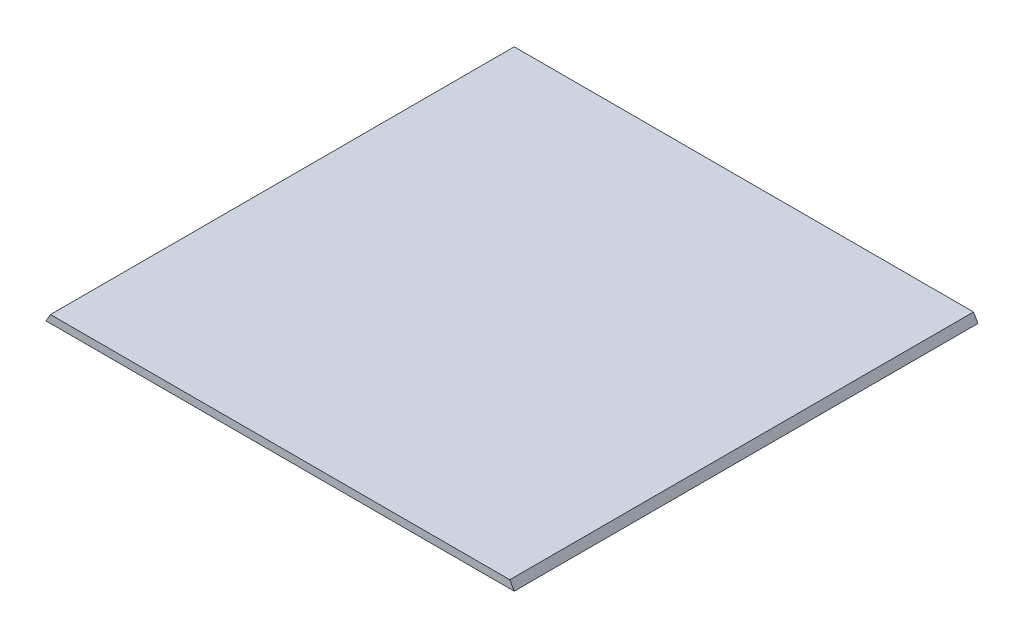
ISO-10303-21;
HEADER;
FILE_DESCRIPTION(('STEP AP214'),'2;1');
FILE_NAME('part.step','',(''),(''),'','','');
FILE_SCHEMA(('AUTOMOTIVE_DESIGN { 1 0 10303 214 1 1 1 1 }'));
ENDSEC;
DATA;
#1=APPLICATION_CONTEXT('core data for automotive mechanical design processes');
#2=APPLICATION_PROTOCOL_DEFINITION('international standard','automotive_design',2000,#1);
#3=PRODUCT_CONTEXT('',#1,'mechanical');
#4=PRODUCT('Part','Part','',(#3));
#5=PRODUCT_RELATED_PRODUCT_CATEGORY('part','',(#4));
#6=PRODUCT_DEFINITION_FORMATION('','',#4);
#7=PRODUCT_DEFINITION_CONTEXT('part definition',#1,'design');
#8=PRODUCT_DEFINITION('design','',#6,#7);
#9=PRODUCT_DEFINITION_SHAPE('','',#8);
#10=(LENGTH_UNIT() NAMED_UNIT(*) SI_UNIT(.MILLI.,.METRE.));
#11=(NAMED_UNIT(*) PLANE_ANGLE_UNIT() SI_UNIT($,.RADIAN.));
#12=(NAMED_UNIT(*) SI_UNIT($,.STERADIAN.) SOLID_ANGLE_UNIT());
#13=UNCERTAINTY_MEASURE_WITH_UNIT(LENGTH_MEASURE(1.E-05),#10,'distance_accuracy_value','');
#14=(GEOMETRIC_REPRESENTATION_CONTEXT(3) GLOBAL_UNCERTAINTY_ASSIGNED_CONTEXT((#13)) GLOBAL_UNIT_ASSIGNED_CONTEXT((#10,
#11,#12)) REPRESENTATION_CONTEXT('',''));
#15=CARTESIAN_POINT('',(0.,0.,0.));
#16=DIRECTION('',(0.,0.,1.));
#17=DIRECTION('',(1.,0.,0.));
#18=AXIS2_PLACEMENT_3D('',#15,#16,#17);
#19=CARTESIAN_POINT('',(0.,6.35,381.));
#20=DIRECTION('',(0.,0.,-1.));
#21=DIRECTION('',(-1.,0.,0.));
#22=AXIS2_PLACEMENT_3D('',#19,#20,#21);
#23=PLANE('',#22);
#24=DIRECTION('',(1.,0.,0.));
#25=VECTOR('',#24,1.);
#26=CARTESIAN_POINT('',(0.,6.35,381.));
#27=LINE('',#26,#25);
#28=CARTESIAN_POINT('',(3.66617420935418,6.35,381.));
#29=VERTEX_POINT('',#28);
#30=CARTESIAN_POINT('',(381.,6.35,381.));
#31=VERTEX_POINT('',#30);
#32=EDGE_CURVE('E99',#29,#31,#27,.T.);
#33=ORIENTED_EDGE('',*,*,#32,.F.);
#34=DIRECTION('',(0.500000000000001,0.866025403784438,0.));
#35=VECTOR('',#34,1.);
#36=CARTESIAN_POINT('',(0.,0.,381.));
#37=LINE('',#36,#35);
#38=CARTESIAN_POINT('',(0.,0.,381.));
#39=VERTEX_POINT('',#38);
#40=EDGE_CURVE('E75',#39,#29,#37,.T.);
#41=ORIENTED_EDGE('',*,*,#40,.F.);
#42=DIRECTION('',(1.,0.,0.));
#43=VECTOR('',#42,1.);
#44=CARTESIAN_POINT('',(0.,0.,381.));
#45=LINE('',#44,#43);
#46=CARTESIAN_POINT('',(384.666174209354,0.,381.));
#47=VERTEX_POINT('',#46);
#48=EDGE_CURVE('E70',#39,#47,#45,.T.);
#49=ORIENTED_EDGE('',*,*,#48,.T.);
#50=DIRECTION('',(-0.499999999999999,0.866025403784439,0.));
#51=VECTOR('',#50,1.);
#52=CARTESIAN_POINT('',(384.666174209354,0.,381.));
#53=LINE('',#52,#51);
#54=EDGE_CURVE('E74',#47,#31,#53,.T.);
#55=ORIENTED_EDGE('',*,*,#54,.T.);
#56=EDGE_LOOP('',(#33,#41,#49,#55));
#57=FACE_BOUND('',#56,.T.);
#58=ADVANCED_FACE('F33',(#57),#23,.F.);
#59=CARTESIAN_POINT('',(0.,6.35,0.));
#60=DIRECTION('',(0.,0.,1.));
#61=DIRECTION('',(1.,0.,0.));
#62=AXIS2_PLACEMENT_3D('',#59,#60,#61);
#63=PLANE('',#62);
#64=DIRECTION('',(-1.,0.,0.));
#65=VECTOR('',#64,1.);
#66=CARTESIAN_POINT('',(0.,0.,0.));
#67=LINE('',#66,#65);
#68=CARTESIAN_POINT('',(384.666174209354,0.,0.));
#69=VERTEX_POINT('',#68);
#70=CARTESIAN_POINT('',(0.,0.,0.));
#71=VERTEX_POINT('',#70);
#72=EDGE_CURVE('E36',#69,#71,#67,.T.);
#73=ORIENTED_EDGE('',*,*,#72,.T.);
#74=DIRECTION('',(0.500000000000001,0.866025403784438,0.));
#75=VECTOR('',#74,1.);
#76=CARTESIAN_POINT('',(0.,0.,0.));
#77=LINE('',#76,#75);
#78=CARTESIAN_POINT('',(3.66617420935418,6.35,0.));
#79=VERTEX_POINT('',#78);
#80=EDGE_CURVE('E92',#71,#79,#77,.T.);
#81=ORIENTED_EDGE('',*,*,#80,.T.);
#82=DIRECTION('',(-1.,0.,0.));
#83=VECTOR('',#82,1.);
#84=CARTESIAN_POINT('',(0.,6.35,0.));
#85=LINE('',#84,#83);
#86=CARTESIAN_POINT('',(381.,6.35,0.));
#87=VERTEX_POINT('',#86);
#88=EDGE_CURVE('E11',#87,#79,#85,.T.);
#89=ORIENTED_EDGE('',*,*,#88,.F.);
#90=DIRECTION('',(0.499999999999999,-0.866025403784439,0.));
#91=VECTOR('',#90,1.);
#92=CARTESIAN_POINT('',(384.666174209354,0.,0.));
#93=LINE('',#92,#91);
#94=EDGE_CURVE('E86',#87,#69,#93,.T.);
#95=ORIENTED_EDGE('',*,*,#94,.T.);
#96=EDGE_LOOP('',(#73,#81,#89,#95));
#97=FACE_BOUND('',#96,.T.);
#98=ADVANCED_FACE('F106',(#97),#63,.F.);
#99=CARTESIAN_POINT('',(0.,6.35,0.));
#100=DIRECTION('',(0.,1.,0.));
#101=DIRECTION('',(0.,0.,1.));
#102=AXIS2_PLACEMENT_3D('',#99,#100,#101);
#103=PLANE('',#102);
#104=DIRECTION('',(0.,0.,1.));
#105=VECTOR('',#104,1.);
#106=CARTESIAN_POINT('',(3.66617420935418,6.35,0.));
#107=LINE('',#106,#105);
#108=EDGE_CURVE('E95',#79,#29,#107,.T.);
#109=ORIENTED_EDGE('',*,*,#108,.T.);
#110=ORIENTED_EDGE('',*,*,#32,.T.);
#111=DIRECTION('',(0.,0.,-1.));
#112=VECTOR('',#111,1.);
#113=CARTESIAN_POINT('',(381.,6.35,0.));
#114=LINE('',#113,#112);
#115=EDGE_CURVE('E42',#31,#87,#114,.T.);
#116=ORIENTED_EDGE('',*,*,#115,.T.);
#117=ORIENTED_EDGE('',*,*,#88,.T.);
#118=EDGE_LOOP('',(#109,#110,#116,#117));
#119=FACE_BOUND('',#118,.T.);
#120=ADVANCED_FACE('F107',(#119),#103,.T.);
#121=CARTESIAN_POINT('',(0.,0.,0.));
#122=DIRECTION('',(0.,1.,0.));
#123=DIRECTION('',(0.,0.,1.));
#124=AXIS2_PLACEMENT_3D('',#121,#122,#123);
#125=PLANE('',#124);
#126=DIRECTION('',(0.,0.,1.));
#127=VECTOR('',#126,1.);
#128=CARTESIAN_POINT('',(0.,0.,0.));
#129=LINE('',#128,#127);
#130=EDGE_CURVE('E78',#71,#39,#129,.T.);
#131=ORIENTED_EDGE('',*,*,#130,.F.);
#132=ORIENTED_EDGE('',*,*,#72,.F.);
#133=DIRECTION('',(0.,0.,1.));
#134=VECTOR('',#133,1.);
#135=CARTESIAN_POINT('',(384.666174209354,0.,-7.33234841870822));
#136=LINE('',#135,#134);
#137=EDGE_CURVE('E80',#69,#47,#136,.T.);
#138=ORIENTED_EDGE('',*,*,#137,.T.);
#139=ORIENTED_EDGE('',*,*,#48,.F.);
#140=EDGE_LOOP('',(#131,#132,#138,#139));
#141=FACE_BOUND('',#140,.T.);
#142=ADVANCED_FACE('F81',(#141),#125,.F.);
#143=CARTESIAN_POINT('',(0.,0.,0.));
#144=DIRECTION('',(0.866025403784438,-0.500000000000001,0.));
#145=DIRECTION('',(0.500000000000001,0.866025403784438,0.));
#146=AXIS2_PLACEMENT_3D('',#143,#144,#145);
#147=PLANE('',#146);
#148=ORIENTED_EDGE('',*,*,#40,.T.);
#149=ORIENTED_EDGE('',*,*,#108,.F.);
#150=ORIENTED_EDGE('',*,*,#80,.F.);
#151=ORIENTED_EDGE('',*,*,#130,.T.);
#152=EDGE_LOOP('',(#148,#149,#150,#151));
#153=FACE_BOUND('',#152,.T.);
#154=ADVANCED_FACE('F104',(#153),#147,.F.);
#155=CARTESIAN_POINT('',(384.666174209354,0.,-7.33234841870822));
#156=DIRECTION('',(0.866025403784439,0.499999999999999,0.));
#157=DIRECTION('',(-0.499999999999999,0.866025403784439,0.));
#158=AXIS2_PLACEMENT_3D('',#155,#156,#157);
#159=PLANE('',#158);
#160=ORIENTED_EDGE('',*,*,#94,.F.);
#161=ORIENTED_EDGE('',*,*,#115,.F.);
#162=ORIENTED_EDGE('',*,*,#54,.F.);
#163=ORIENTED_EDGE('',*,*,#137,.F.);
#164=EDGE_LOOP('',(#160,#161,#162,#163));
#165=FACE_BOUND('',#164,.T.);
#166=ADVANCED_FACE('F88',(#165),#159,.T.);
#167=CLOSED_SHELL('',(#58,#98,#120,#142,#154,#166));
#168=MANIFOLD_SOLID_BREP('B2',#167);
#169=ADVANCED_BREP_SHAPE_REPRESENTATION('',(#18,#168),#14);
#170=SHAPE_DEFINITION_REPRESENTATION(#9,#169);
ENDSEC;
END-ISO-10303-21;
